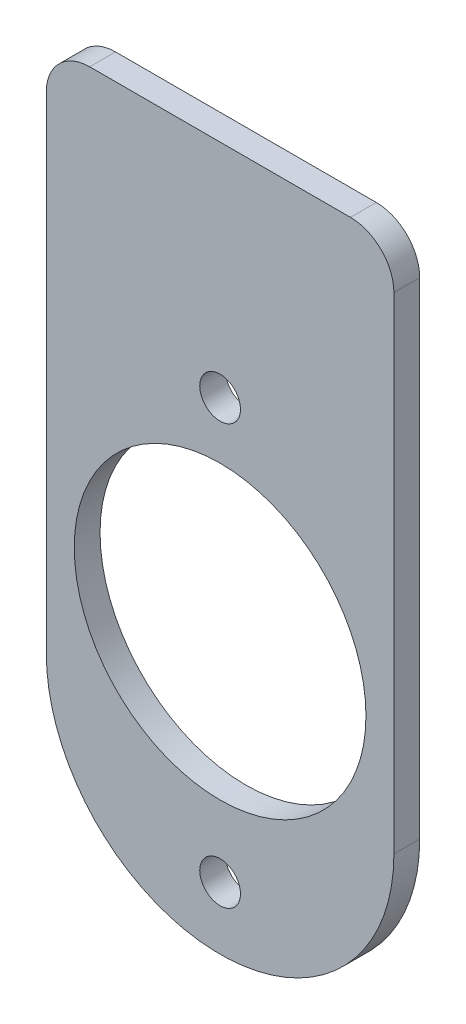
ISO-10303-21;
HEADER;
FILE_DESCRIPTION(('STEP AP214'),'2;1');
FILE_NAME('part.step','',(''),(''),'','','');
FILE_SCHEMA(('AUTOMOTIVE_DESIGN { 1 0 10303 214 1 1 1 1 }'));
ENDSEC;
DATA;
#1=APPLICATION_CONTEXT('core data for automotive mechanical design processes');
#2=APPLICATION_PROTOCOL_DEFINITION('international standard','automotive_design',2000,#1);
#3=PRODUCT_CONTEXT('',#1,'mechanical');
#4=PRODUCT('Part','Part','',(#3));
#5=PRODUCT_RELATED_PRODUCT_CATEGORY('part','',(#4));
#6=PRODUCT_DEFINITION_FORMATION('','',#4);
#7=PRODUCT_DEFINITION_CONTEXT('part definition',#1,'design');
#8=PRODUCT_DEFINITION('design','',#6,#7);
#9=PRODUCT_DEFINITION_SHAPE('','',#8);
#10=(LENGTH_UNIT() NAMED_UNIT(*) SI_UNIT(.MILLI.,.METRE.));
#11=(NAMED_UNIT(*) PLANE_ANGLE_UNIT() SI_UNIT($,.RADIAN.));
#12=(NAMED_UNIT(*) SI_UNIT($,.STERADIAN.) SOLID_ANGLE_UNIT());
#13=UNCERTAINTY_MEASURE_WITH_UNIT(LENGTH_MEASURE(1.E-05),#10,'distance_accuracy_value','');
#14=(GEOMETRIC_REPRESENTATION_CONTEXT(3) GLOBAL_UNCERTAINTY_ASSIGNED_CONTEXT((#13)) GLOBAL_UNIT_ASSIGNED_CONTEXT((#10,
#11,#12)) REPRESENTATION_CONTEXT('',''));
#15=CARTESIAN_POINT('',(0.,0.,0.));
#16=DIRECTION('',(0.,0.,1.));
#17=DIRECTION('',(1.,0.,0.));
#18=AXIS2_PLACEMENT_3D('',#15,#16,#17);
#19=CARTESIAN_POINT('',(0.,2.66,-1.7));
#20=DIRECTION('',(0.,0.,-1.));
#21=DIRECTION('',(0.,-1.,0.));
#22=AXIS2_PLACEMENT_3D('',#19,#20,#21);
#23=PLANE('',#22);
#24=CARTESIAN_POINT('',(0.,0.,-1.7));
#25=DIRECTION('',(0.,0.,1.));
#26=DIRECTION('',(1.,0.,0.));
#27=AXIS2_PLACEMENT_3D('',#24,#25,#26);
#28=CIRCLE('',#27,5.37025);
#29=CARTESIAN_POINT('',(-5.37025,0.,-1.7));
#30=VERTEX_POINT('',#29);
#31=EDGE_CURVE('E21',#30,#30,#28,.T.);
#32=ORIENTED_EDGE('',*,*,#31,.F.);
#33=EDGE_LOOP('',(#32));
#34=FACE_BOUND('',#33,.T.);
#35=CARTESIAN_POINT('',(0.,7.46,-1.7));
#36=DIRECTION('',(0.,0.,1.));
#37=DIRECTION('',(1.,0.,0.));
#38=AXIS2_PLACEMENT_3D('',#35,#36,#37);
#39=CIRCLE('',#38,0.75);
#40=CARTESIAN_POINT('',(-0.75,7.46,-1.7));
#41=VERTEX_POINT('',#40);
#42=EDGE_CURVE('E157',#41,#41,#39,.T.);
#43=ORIENTED_EDGE('',*,*,#42,.F.);
#44=EDGE_LOOP('',(#43));
#45=FACE_BOUND('',#44,.T.);
#46=CARTESIAN_POINT('',(0.,-7.99,-1.7));
#47=DIRECTION('',(0.,0.,1.));
#48=DIRECTION('',(1.,0.,0.));
#49=AXIS2_PLACEMENT_3D('',#46,#47,#48);
#50=CIRCLE('',#49,0.75);
#51=CARTESIAN_POINT('',(-0.75,-7.99,-1.7));
#52=VERTEX_POINT('',#51);
#53=EDGE_CURVE('E181',#52,#52,#50,.T.);
#54=ORIENTED_EDGE('',*,*,#53,.F.);
#55=EDGE_LOOP('',(#54));
#56=FACE_BOUND('',#55,.T.);
#57=DIRECTION('',(0.,-1.,0.));
#58=VECTOR('',#57,1.);
#59=CARTESIAN_POINT('',(6.4,12.41,-1.7));
#60=LINE('',#59,#58);
#61=CARTESIAN_POINT('',(6.4,14.01,-1.7));
#62=VERTEX_POINT('',#61);
#63=CARTESIAN_POINT('',(6.4,-3.89,-1.7));
#64=VERTEX_POINT('',#63);
#65=EDGE_CURVE('E28',#62,#64,#60,.T.);
#66=ORIENTED_EDGE('',*,*,#65,.F.);
#67=CARTESIAN_POINT('',(4.8,14.01,-1.7));
#68=DIRECTION('',(0.,0.,-1.));
#69=DIRECTION('',(0.,1.,0.));
#70=AXIS2_PLACEMENT_3D('',#67,#68,#69);
#71=CIRCLE('',#70,1.6);
#72=CARTESIAN_POINT('',(4.8,15.61,-1.7));
#73=VERTEX_POINT('',#72);
#74=EDGE_CURVE('E148',#73,#62,#71,.T.);
#75=ORIENTED_EDGE('',*,*,#74,.F.);
#76=DIRECTION('',(1.,0.,0.));
#77=VECTOR('',#76,1.);
#78=CARTESIAN_POINT('',(-4.8,15.61,-1.7));
#79=LINE('',#78,#77);
#80=CARTESIAN_POINT('',(-4.8,15.61,-1.7));
#81=VERTEX_POINT('',#80);
#82=EDGE_CURVE('E128',#81,#73,#79,.T.);
#83=ORIENTED_EDGE('',*,*,#82,.F.);
#84=CARTESIAN_POINT('',(-4.8,14.01,-1.7));
#85=DIRECTION('',(0.,0.,-1.));
#86=DIRECTION('',(-1.,0.,0.));
#87=AXIS2_PLACEMENT_3D('',#84,#85,#86);
#88=CIRCLE('',#87,1.6);
#89=CARTESIAN_POINT('',(-6.4,14.01,-1.7));
#90=VERTEX_POINT('',#89);
#91=EDGE_CURVE('E111',#90,#81,#88,.T.);
#92=ORIENTED_EDGE('',*,*,#91,.F.);
#93=DIRECTION('',(0.,1.,0.));
#94=VECTOR('',#93,1.);
#95=CARTESIAN_POINT('',(-6.4,-3.89,-1.7));
#96=LINE('',#95,#94);
#97=CARTESIAN_POINT('',(-6.4,-3.89,-1.7));
#98=VERTEX_POINT('',#97);
#99=EDGE_CURVE('E175',#98,#90,#96,.T.);
#100=ORIENTED_EDGE('',*,*,#99,.F.);
#101=CARTESIAN_POINT('',(0.,-3.89,-1.7));
#102=DIRECTION('',(0.,0.,-1.));
#103=DIRECTION('',(1.,0.,0.));
#104=AXIS2_PLACEMENT_3D('',#101,#102,#103);
#105=CIRCLE('',#104,6.4);
#106=EDGE_CURVE('E162',#64,#98,#105,.T.);
#107=ORIENTED_EDGE('',*,*,#106,.F.);
#108=EDGE_LOOP('',(#66,#75,#83,#92,#100,#107));
#109=FACE_BOUND('',#108,.T.);
#110=ADVANCED_FACE('F17',(#34,#45,#56,#109),#23,.F.);
#111=CARTESIAN_POINT('',(0.,2.66,-2.65));
#112=DIRECTION('',(0.,0.,-1.));
#113=DIRECTION('',(0.,-1.,0.));
#114=AXIS2_PLACEMENT_3D('',#111,#112,#113);
#115=PLANE('',#114);
#116=CARTESIAN_POINT('',(0.,0.,-2.65));
#117=DIRECTION('',(0.,0.,1.));
#118=DIRECTION('',(1.,0.,0.));
#119=AXIS2_PLACEMENT_3D('',#116,#117,#118);
#120=CIRCLE('',#119,5.37025);
#121=CARTESIAN_POINT('',(-5.37025,0.,-2.65));
#122=VERTEX_POINT('',#121);
#123=EDGE_CURVE('E167',#122,#122,#120,.T.);
#124=ORIENTED_EDGE('',*,*,#123,.T.);
#125=EDGE_LOOP('',(#124));
#126=FACE_BOUND('',#125,.T.);
#127=CARTESIAN_POINT('',(0.,7.46,-2.65));
#128=DIRECTION('',(0.,0.,1.));
#129=DIRECTION('',(1.,0.,0.));
#130=AXIS2_PLACEMENT_3D('',#127,#128,#129);
#131=CIRCLE('',#130,0.75);
#132=CARTESIAN_POINT('',(-0.75,7.46,-2.65));
#133=VERTEX_POINT('',#132);
#134=EDGE_CURVE('E158',#133,#133,#131,.T.);
#135=ORIENTED_EDGE('',*,*,#134,.T.);
#136=EDGE_LOOP('',(#135));
#137=FACE_BOUND('',#136,.T.);
#138=CARTESIAN_POINT('',(0.,-7.99,-2.65));
#139=DIRECTION('',(0.,0.,1.));
#140=DIRECTION('',(1.,0.,0.));
#141=AXIS2_PLACEMENT_3D('',#138,#139,#140);
#142=CIRCLE('',#141,0.75);
#143=CARTESIAN_POINT('',(-0.75,-7.99,-2.65));
#144=VERTEX_POINT('',#143);
#145=EDGE_CURVE('E152',#144,#144,#142,.T.);
#146=ORIENTED_EDGE('',*,*,#145,.T.);
#147=EDGE_LOOP('',(#146));
#148=FACE_BOUND('',#147,.T.);
#149=DIRECTION('',(0.,-1.,0.));
#150=VECTOR('',#149,1.);
#151=CARTESIAN_POINT('',(6.4,12.41,-2.65));
#152=LINE('',#151,#150);
#153=CARTESIAN_POINT('',(6.4,14.01,-2.65));
#154=VERTEX_POINT('',#153);
#155=CARTESIAN_POINT('',(6.4,-3.89,-2.65));
#156=VERTEX_POINT('',#155);
#157=EDGE_CURVE('E11',#154,#156,#152,.T.);
#158=ORIENTED_EDGE('',*,*,#157,.T.);
#159=CARTESIAN_POINT('',(0.,-3.89,-2.65));
#160=DIRECTION('',(0.,0.,-1.));
#161=DIRECTION('',(1.,0.,0.));
#162=AXIS2_PLACEMENT_3D('',#159,#160,#161);
#163=CIRCLE('',#162,6.4);
#164=CARTESIAN_POINT('',(-6.4,-3.89,-2.65));
#165=VERTEX_POINT('',#164);
#166=EDGE_CURVE('E172',#156,#165,#163,.T.);
#167=ORIENTED_EDGE('',*,*,#166,.T.);
#168=DIRECTION('',(0.,1.,0.));
#169=VECTOR('',#168,1.);
#170=CARTESIAN_POINT('',(-6.4,-3.89,-2.65));
#171=LINE('',#170,#169);
#172=CARTESIAN_POINT('',(-6.4,14.01,-2.65));
#173=VERTEX_POINT('',#172);
#174=EDGE_CURVE('E163',#165,#173,#171,.T.);
#175=ORIENTED_EDGE('',*,*,#174,.T.);
#176=CARTESIAN_POINT('',(-4.8,14.01,-2.65));
#177=DIRECTION('',(0.,0.,-1.));
#178=DIRECTION('',(-1.,0.,0.));
#179=AXIS2_PLACEMENT_3D('',#176,#177,#178);
#180=CIRCLE('',#179,1.6);
#181=CARTESIAN_POINT('',(-4.8,15.61,-2.65));
#182=VERTEX_POINT('',#181);
#183=EDGE_CURVE('E124',#173,#182,#180,.T.);
#184=ORIENTED_EDGE('',*,*,#183,.T.);
#185=DIRECTION('',(1.,0.,0.));
#186=VECTOR('',#185,1.);
#187=CARTESIAN_POINT('',(-4.8,15.61,-2.65));
#188=LINE('',#187,#186);
#189=CARTESIAN_POINT('',(4.8,15.61,-2.65));
#190=VERTEX_POINT('',#189);
#191=EDGE_CURVE('E117',#182,#190,#188,.T.);
#192=ORIENTED_EDGE('',*,*,#191,.T.);
#193=CARTESIAN_POINT('',(4.8,14.01,-2.65));
#194=DIRECTION('',(0.,0.,-1.));
#195=DIRECTION('',(0.,1.,0.));
#196=AXIS2_PLACEMENT_3D('',#193,#194,#195);
#197=CIRCLE('',#196,1.6);
#198=EDGE_CURVE('E121',#190,#154,#197,.T.);
#199=ORIENTED_EDGE('',*,*,#198,.T.);
#200=EDGE_LOOP('',(#158,#167,#175,#184,#192,#199));
#201=FACE_BOUND('',#200,.T.);
#202=ADVANCED_FACE('F119',(#126,#137,#148,#201),#115,.T.);
#203=CARTESIAN_POINT('',(6.4,14.01,-1.7));
#204=DIRECTION('',(1.,0.,0.));
#205=DIRECTION('',(0.,1.,0.));
#206=AXIS2_PLACEMENT_3D('',#203,#204,#205);
#207=PLANE('',#206);
#208=ORIENTED_EDGE('',*,*,#65,.T.);
#209=DIRECTION('',(0.,0.,-1.));
#210=VECTOR('',#209,1.);
#211=CARTESIAN_POINT('',(6.4,-3.89,-1.7));
#212=LINE('',#211,#210);
#213=EDGE_CURVE('E180',#64,#156,#212,.T.);
#214=ORIENTED_EDGE('',*,*,#213,.T.);
#215=ORIENTED_EDGE('',*,*,#157,.F.);
#216=DIRECTION('',(0.,0.,-1.));
#217=VECTOR('',#216,1.);
#218=CARTESIAN_POINT('',(6.4,14.01,-1.7));
#219=LINE('',#218,#217);
#220=EDGE_CURVE('E141',#62,#154,#219,.T.);
#221=ORIENTED_EDGE('',*,*,#220,.F.);
#222=EDGE_LOOP('',(#208,#214,#215,#221));
#223=FACE_BOUND('',#222,.T.);
#224=ADVANCED_FACE('F216',(#223),#207,.T.);
#225=CARTESIAN_POINT('',(0.,-3.89,-1.7));
#226=DIRECTION('',(0.,0.,-1.));
#227=DIRECTION('',(1.,0.,0.));
#228=AXIS2_PLACEMENT_3D('',#225,#226,#227);
#229=CYLINDRICAL_SURFACE('',#228,6.4);
#230=ORIENTED_EDGE('',*,*,#106,.T.);
#231=DIRECTION('',(0.,0.,-1.));
#232=VECTOR('',#231,1.);
#233=CARTESIAN_POINT('',(-6.4,-3.89,-1.7));
#234=LINE('',#233,#232);
#235=EDGE_CURVE('E159',#98,#165,#234,.T.);
#236=ORIENTED_EDGE('',*,*,#235,.T.);
#237=ORIENTED_EDGE('',*,*,#166,.F.);
#238=ORIENTED_EDGE('',*,*,#213,.F.);
#239=EDGE_LOOP('',(#230,#236,#237,#238));
#240=FACE_BOUND('',#239,.T.);
#241=ADVANCED_FACE('F320',(#240),#229,.T.);
#242=CARTESIAN_POINT('',(-6.4,-3.89,-1.7));
#243=DIRECTION('',(-1.,0.,0.));
#244=DIRECTION('',(0.,0.,1.));
#245=AXIS2_PLACEMENT_3D('',#242,#243,#244);
#246=PLANE('',#245);
#247=ORIENTED_EDGE('',*,*,#99,.T.);
#248=DIRECTION('',(0.,0.,-1.));
#249=VECTOR('',#248,1.);
#250=CARTESIAN_POINT('',(-6.4,14.01,-1.7));
#251=LINE('',#250,#249);
#252=EDGE_CURVE('E191',#90,#173,#251,.T.);
#253=ORIENTED_EDGE('',*,*,#252,.T.);
#254=ORIENTED_EDGE('',*,*,#174,.F.);
#255=ORIENTED_EDGE('',*,*,#235,.F.);
#256=EDGE_LOOP('',(#247,#253,#254,#255));
#257=FACE_BOUND('',#256,.T.);
#258=ADVANCED_FACE('F19',(#257),#246,.T.);
#259=CARTESIAN_POINT('',(-4.8,14.01,-1.7));
#260=DIRECTION('',(0.,0.,-1.));
#261=DIRECTION('',(-1.,0.,0.));
#262=AXIS2_PLACEMENT_3D('',#259,#260,#261);
#263=CYLINDRICAL_SURFACE('',#262,1.6);
#264=ORIENTED_EDGE('',*,*,#91,.T.);
#265=DIRECTION('',(0.,0.,-1.));
#266=VECTOR('',#265,1.);
#267=CARTESIAN_POINT('',(-4.8,15.61,-1.7));
#268=LINE('',#267,#266);
#269=EDGE_CURVE('E127',#81,#182,#268,.T.);
#270=ORIENTED_EDGE('',*,*,#269,.T.);
#271=ORIENTED_EDGE('',*,*,#183,.F.);
#272=ORIENTED_EDGE('',*,*,#252,.F.);
#273=EDGE_LOOP('',(#264,#270,#271,#272));
#274=FACE_BOUND('',#273,.T.);
#275=ADVANCED_FACE('F267',(#274),#263,.T.);
#276=CARTESIAN_POINT('',(-4.8,15.61,-1.7));
#277=DIRECTION('',(0.,1.,0.));
#278=DIRECTION('',(1.,0.,0.));
#279=AXIS2_PLACEMENT_3D('',#276,#277,#278);
#280=PLANE('',#279);
#281=ORIENTED_EDGE('',*,*,#82,.T.);
#282=DIRECTION('',(0.,0.,-1.));
#283=VECTOR('',#282,1.);
#284=CARTESIAN_POINT('',(4.8,15.61,-1.7));
#285=LINE('',#284,#283);
#286=EDGE_CURVE('E131',#73,#190,#285,.T.);
#287=ORIENTED_EDGE('',*,*,#286,.T.);
#288=ORIENTED_EDGE('',*,*,#191,.F.);
#289=ORIENTED_EDGE('',*,*,#269,.F.);
#290=EDGE_LOOP('',(#281,#287,#288,#289));
#291=FACE_BOUND('',#290,.T.);
#292=ADVANCED_FACE('F132',(#291),#280,.T.);
#293=CARTESIAN_POINT('',(4.8,14.01,-1.7));
#294=DIRECTION('',(0.,0.,-1.));
#295=DIRECTION('',(0.,1.,0.));
#296=AXIS2_PLACEMENT_3D('',#293,#294,#295);
#297=CYLINDRICAL_SURFACE('',#296,1.6);
#298=ORIENTED_EDGE('',*,*,#74,.T.);
#299=ORIENTED_EDGE('',*,*,#220,.T.);
#300=ORIENTED_EDGE('',*,*,#198,.F.);
#301=ORIENTED_EDGE('',*,*,#286,.F.);
#302=EDGE_LOOP('',(#298,#299,#300,#301));
#303=FACE_BOUND('',#302,.T.);
#304=ADVANCED_FACE('F139',(#303),#297,.T.);
#305=CARTESIAN_POINT('',(0.,-7.99,-1.7));
#306=DIRECTION('',(0.,0.,-1.));
#307=DIRECTION('',(1.,0.,0.));
#308=AXIS2_PLACEMENT_3D('',#305,#306,#307);
#309=CYLINDRICAL_SURFACE('',#308,0.75);
#310=ORIENTED_EDGE('',*,*,#145,.F.);
#311=DIRECTION('',(0.,0.,1.));
#312=VECTOR('',#311,1.);
#313=CARTESIAN_POINT('',(-0.75,-7.99,-1.7));
#314=LINE('',#313,#312);
#315=EDGE_CURVE('E184',#144,#52,#314,.T.);
#316=ORIENTED_EDGE('',*,*,#315,.T.);
#317=ORIENTED_EDGE('',*,*,#53,.T.);
#318=ORIENTED_EDGE('',*,*,#315,.F.);
#319=EDGE_LOOP('',(#310,#316,#317,#318));
#320=FACE_BOUND('',#319,.T.);
#321=ADVANCED_FACE('F203',(#320),#309,.F.);
#322=CARTESIAN_POINT('',(0.,7.46,-1.7));
#323=DIRECTION('',(0.,0.,-1.));
#324=DIRECTION('',(1.,0.,0.));
#325=AXIS2_PLACEMENT_3D('',#322,#323,#324);
#326=CYLINDRICAL_SURFACE('',#325,0.75);
#327=ORIENTED_EDGE('',*,*,#134,.F.);
#328=DIRECTION('',(0.,0.,1.));
#329=VECTOR('',#328,1.);
#330=CARTESIAN_POINT('',(-0.75,7.46,-1.7));
#331=LINE('',#330,#329);
#332=EDGE_CURVE('E153',#133,#41,#331,.T.);
#333=ORIENTED_EDGE('',*,*,#332,.T.);
#334=ORIENTED_EDGE('',*,*,#42,.T.);
#335=ORIENTED_EDGE('',*,*,#332,.F.);
#336=EDGE_LOOP('',(#327,#333,#334,#335));
#337=FACE_BOUND('',#336,.T.);
#338=ADVANCED_FACE('F307',(#337),#326,.F.);
#339=CARTESIAN_POINT('',(0.,0.,-1.7));
#340=DIRECTION('',(0.,0.,-1.));
#341=DIRECTION('',(1.,0.,0.));
#342=AXIS2_PLACEMENT_3D('',#339,#340,#341);
#343=CYLINDRICAL_SURFACE('',#342,5.37025);
#344=ORIENTED_EDGE('',*,*,#123,.F.);
#345=DIRECTION('',(0.,0.,1.));
#346=VECTOR('',#345,1.);
#347=CARTESIAN_POINT('',(-5.37025,0.,-1.7));
#348=LINE('',#347,#346);
#349=EDGE_CURVE('E74',#122,#30,#348,.T.);
#350=ORIENTED_EDGE('',*,*,#349,.T.);
#351=ORIENTED_EDGE('',*,*,#31,.T.);
#352=ORIENTED_EDGE('',*,*,#349,.F.);
#353=EDGE_LOOP('',(#344,#350,#351,#352));
#354=FACE_BOUND('',#353,.T.);
#355=ADVANCED_FACE('F302',(#354),#343,.F.);
#356=CLOSED_SHELL('',(#110,#202,#224,#241,#258,#275,#292,#304,#321,#338,#355));
#357=MANIFOLD_SOLID_BREP('B1',#356);
#358=ADVANCED_BREP_SHAPE_REPRESENTATION('',(#18,#357),#14);
#359=SHAPE_DEFINITION_REPRESENTATION(#9,#358);
ENDSEC;
END-ISO-10303-21;
